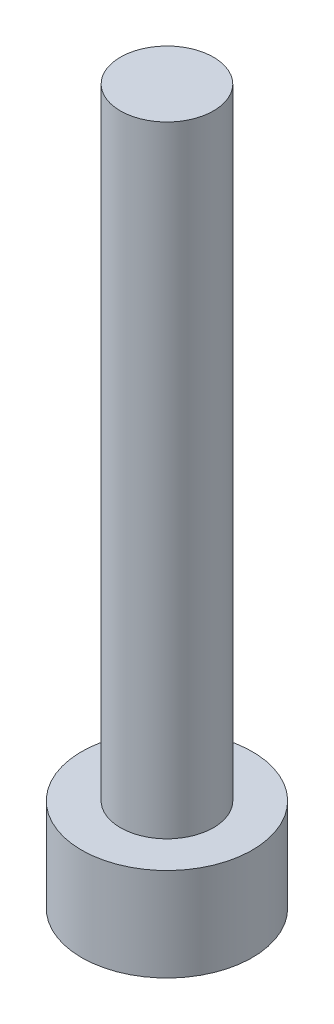
ISO-10303-21;
HEADER;
FILE_DESCRIPTION(('STEP AP214'),'2;1');
FILE_NAME('part.step','',(''),(''),'','','');
FILE_SCHEMA(('AUTOMOTIVE_DESIGN { 1 0 10303 214 1 1 1 1 }'));
ENDSEC;
DATA;
#1=APPLICATION_CONTEXT('core data for automotive mechanical design processes');
#2=APPLICATION_PROTOCOL_DEFINITION('international standard','automotive_design',2000,#1);
#3=PRODUCT_CONTEXT('',#1,'mechanical');
#4=PRODUCT('Part','Part','',(#3));
#5=PRODUCT_RELATED_PRODUCT_CATEGORY('part','',(#4));
#6=PRODUCT_DEFINITION_FORMATION('','',#4);
#7=PRODUCT_DEFINITION_CONTEXT('part definition',#1,'design');
#8=PRODUCT_DEFINITION('design','',#6,#7);
#9=PRODUCT_DEFINITION_SHAPE('','',#8);
#10=(LENGTH_UNIT() NAMED_UNIT(*) SI_UNIT(.MILLI.,.METRE.));
#11=(NAMED_UNIT(*) PLANE_ANGLE_UNIT() SI_UNIT($,.RADIAN.));
#12=(NAMED_UNIT(*) SI_UNIT($,.STERADIAN.) SOLID_ANGLE_UNIT());
#13=UNCERTAINTY_MEASURE_WITH_UNIT(LENGTH_MEASURE(1.E-05),#10,'distance_accuracy_value','');
#14=(GEOMETRIC_REPRESENTATION_CONTEXT(3) GLOBAL_UNCERTAINTY_ASSIGNED_CONTEXT((#13)) GLOBAL_UNIT_ASSIGNED_CONTEXT((#10,
#11,#12)) REPRESENTATION_CONTEXT('',''));
#15=CARTESIAN_POINT('',(0.,0.,0.));
#16=DIRECTION('',(0.,0.,1.));
#17=DIRECTION('',(1.,0.,0.));
#18=AXIS2_PLACEMENT_3D('',#15,#16,#17);
#19=CARTESIAN_POINT('',(0.,3.,0.));
#20=DIRECTION('',(0.,1.,0.));
#21=DIRECTION('',(0.,0.,1.));
#22=AXIS2_PLACEMENT_3D('',#19,#20,#21);
#23=PLANE('',#22);
#24=CARTESIAN_POINT('',(0.,3.,0.));
#25=DIRECTION('',(0.,1.,0.));
#26=DIRECTION('',(0.,0.,1.));
#27=AXIS2_PLACEMENT_3D('',#24,#25,#26);
#28=CIRCLE('',#27,2.75);
#29=CARTESIAN_POINT('',(0.,3.,2.75));
#30=VERTEX_POINT('',#29);
#31=EDGE_CURVE('E11',#30,#30,#28,.T.);
#32=ORIENTED_EDGE('',*,*,#31,.T.);
#33=EDGE_LOOP('',(#32));
#34=FACE_BOUND('',#33,.T.);
#35=CARTESIAN_POINT('',(0.,3.,0.));
#36=DIRECTION('',(0.,1.,0.));
#37=DIRECTION('',(0.,0.,1.));
#38=AXIS2_PLACEMENT_3D('',#35,#36,#37);
#39=CIRCLE('',#38,1.5);
#40=CARTESIAN_POINT('',(0.,3.,1.5));
#41=VERTEX_POINT('',#40);
#42=EDGE_CURVE('E135',#41,#41,#39,.T.);
#43=ORIENTED_EDGE('',*,*,#42,.F.);
#44=EDGE_LOOP('',(#43));
#45=FACE_BOUND('',#44,.T.);
#46=ADVANCED_FACE('F33',(#34,#45),#23,.T.);
#47=CARTESIAN_POINT('',(0.,3.,0.));
#48=DIRECTION('',(0.,-1.,0.));
#49=DIRECTION('',(0.,0.,-1.));
#50=AXIS2_PLACEMENT_3D('',#47,#48,#49);
#51=CYLINDRICAL_SURFACE('',#50,2.75);
#52=ORIENTED_EDGE('',*,*,#31,.F.);
#53=EDGE_LOOP('',(#52));
#54=FACE_BOUND('',#53,.T.);
#55=CARTESIAN_POINT('',(0.,0.,0.));
#56=DIRECTION('',(0.,1.,0.));
#57=DIRECTION('',(0.,0.,1.));
#58=AXIS2_PLACEMENT_3D('',#55,#56,#57);
#59=CIRCLE('',#58,2.75);
#60=CARTESIAN_POINT('',(0.,0.,2.75));
#61=VERTEX_POINT('',#60);
#62=EDGE_CURVE('E37',#61,#61,#59,.T.);
#63=ORIENTED_EDGE('',*,*,#62,.T.);
#64=EDGE_LOOP('',(#63));
#65=FACE_BOUND('',#64,.T.);
#66=ADVANCED_FACE('F35',(#54,#65),#51,.T.);
#67=CARTESIAN_POINT('',(0.,0.,0.));
#68=DIRECTION('',(0.,1.,0.));
#69=DIRECTION('',(0.,0.,1.));
#70=AXIS2_PLACEMENT_3D('',#67,#68,#69);
#71=PLANE('',#70);
#72=DIRECTION('',(-0.866025403784439,0.,-0.5));
#73=VECTOR('',#72,1.);
#74=CARTESIAN_POINT('',(0.,0.,1.44337567297406));
#75=LINE('',#74,#73);
#76=CARTESIAN_POINT('',(0.,0.,1.44337567297406));
#77=VERTEX_POINT('',#76);
#78=CARTESIAN_POINT('',(-1.25,0.,0.721687836487033));
#79=VERTEX_POINT('',#78);
#80=EDGE_CURVE('E122',#77,#79,#75,.T.);
#81=ORIENTED_EDGE('',*,*,#80,.F.);
#82=DIRECTION('',(-0.866025403784439,0.,0.5));
#83=VECTOR('',#82,1.);
#84=CARTESIAN_POINT('',(1.25,0.,0.721687836487032));
#85=LINE('',#84,#83);
#86=CARTESIAN_POINT('',(1.25,0.,0.721687836487032));
#87=VERTEX_POINT('',#86);
#88=EDGE_CURVE('E48',#87,#77,#85,.T.);
#89=ORIENTED_EDGE('',*,*,#88,.F.);
#90=DIRECTION('',(0.,0.,1.));
#91=VECTOR('',#90,1.);
#92=CARTESIAN_POINT('',(1.25,0.,-0.721687836487033));
#93=LINE('',#92,#91);
#94=CARTESIAN_POINT('',(1.25,0.,-0.721687836487033));
#95=VERTEX_POINT('',#94);
#96=EDGE_CURVE('E131',#95,#87,#93,.T.);
#97=ORIENTED_EDGE('',*,*,#96,.F.);
#98=DIRECTION('',(0.866025403784439,0.,0.5));
#99=VECTOR('',#98,1.);
#100=CARTESIAN_POINT('',(0.,0.,-1.44337567297406));
#101=LINE('',#100,#99);
#102=CARTESIAN_POINT('',(0.,0.,-1.44337567297406));
#103=VERTEX_POINT('',#102);
#104=EDGE_CURVE('E129',#103,#95,#101,.T.);
#105=ORIENTED_EDGE('',*,*,#104,.F.);
#106=DIRECTION('',(0.866025403784439,0.,-0.5));
#107=VECTOR('',#106,1.);
#108=CARTESIAN_POINT('',(-1.25,0.,-0.721687836487032));
#109=LINE('',#108,#107);
#110=CARTESIAN_POINT('',(-1.25,0.,-0.721687836487032));
#111=VERTEX_POINT('',#110);
#112=EDGE_CURVE('E96',#111,#103,#109,.T.);
#113=ORIENTED_EDGE('',*,*,#112,.F.);
#114=DIRECTION('',(0.,0.,-1.));
#115=VECTOR('',#114,1.);
#116=CARTESIAN_POINT('',(-1.25,0.,0.721687836487033));
#117=LINE('',#116,#115);
#118=EDGE_CURVE('E125',#79,#111,#117,.T.);
#119=ORIENTED_EDGE('',*,*,#118,.F.);
#120=EDGE_LOOP('',(#81,#89,#97,#105,#113,#119));
#121=FACE_BOUND('',#120,.T.);
#122=ORIENTED_EDGE('',*,*,#62,.F.);
#123=EDGE_LOOP('',(#122));
#124=FACE_BOUND('',#123,.T.);
#125=ADVANCED_FACE('F155',(#121,#124),#71,.F.);
#126=CARTESIAN_POINT('',(0.,23.,0.));
#127=DIRECTION('',(0.,-1.,0.));
#128=DIRECTION('',(0.,0.,-1.));
#129=AXIS2_PLACEMENT_3D('',#126,#127,#128);
#130=CYLINDRICAL_SURFACE('',#129,1.5);
#131=CARTESIAN_POINT('',(0.,23.,0.));
#132=DIRECTION('',(0.,1.,0.));
#133=DIRECTION('',(0.,0.,1.));
#134=AXIS2_PLACEMENT_3D('',#131,#132,#133);
#135=CIRCLE('',#134,1.5);
#136=CARTESIAN_POINT('',(0.,23.,1.5));
#137=VERTEX_POINT('',#136);
#138=EDGE_CURVE('E141',#137,#137,#135,.T.);
#139=ORIENTED_EDGE('',*,*,#138,.F.);
#140=EDGE_LOOP('',(#139));
#141=FACE_BOUND('',#140,.T.);
#142=ORIENTED_EDGE('',*,*,#42,.T.);
#143=EDGE_LOOP('',(#142));
#144=FACE_BOUND('',#143,.T.);
#145=ADVANCED_FACE('F147',(#141,#144),#130,.T.);
#146=CARTESIAN_POINT('',(0.,23.,0.));
#147=DIRECTION('',(0.,1.,0.));
#148=DIRECTION('',(0.,0.,1.));
#149=AXIS2_PLACEMENT_3D('',#146,#147,#148);
#150=PLANE('',#149);
#151=ORIENTED_EDGE('',*,*,#138,.T.);
#152=EDGE_LOOP('',(#151));
#153=FACE_BOUND('',#152,.T.);
#154=ADVANCED_FACE('F164',(#153),#150,.T.);
#155=CARTESIAN_POINT('',(1.25,1.5,0.721687836487032));
#156=DIRECTION('',(0.5,0.,0.866025403784439));
#157=DIRECTION('',(0.866025403784439,0.,-0.5));
#158=AXIS2_PLACEMENT_3D('',#155,#156,#157);
#159=PLANE('',#158);
#160=ORIENTED_EDGE('',*,*,#88,.T.);
#161=DIRECTION('',(0.,-1.,0.));
#162=VECTOR('',#161,1.);
#163=CARTESIAN_POINT('',(0.,1.5,1.44337567297406));
#164=LINE('',#163,#162);
#165=CARTESIAN_POINT('',(0.,1.5,1.44337567297406));
#166=VERTEX_POINT('',#165);
#167=EDGE_CURVE('E78',#166,#77,#164,.T.);
#168=ORIENTED_EDGE('',*,*,#167,.F.);
#169=DIRECTION('',(-0.866025403784439,0.,0.5));
#170=VECTOR('',#169,1.);
#171=CARTESIAN_POINT('',(1.25,1.5,0.721687836487032));
#172=LINE('',#171,#170);
#173=CARTESIAN_POINT('',(1.25,1.5,0.721687836487032));
#174=VERTEX_POINT('',#173);
#175=EDGE_CURVE('E133',#174,#166,#172,.T.);
#176=ORIENTED_EDGE('',*,*,#175,.F.);
#177=DIRECTION('',(0.,-1.,0.));
#178=VECTOR('',#177,1.);
#179=CARTESIAN_POINT('',(1.25,1.5,0.721687836487032));
#180=LINE('',#179,#178);
#181=EDGE_CURVE('E56',#174,#87,#180,.T.);
#182=ORIENTED_EDGE('',*,*,#181,.T.);
#183=EDGE_LOOP('',(#160,#168,#176,#182));
#184=FACE_BOUND('',#183,.T.);
#185=ADVANCED_FACE('F176',(#184),#159,.F.);
#186=CARTESIAN_POINT('',(1.25,1.5,-0.721687836487033));
#187=DIRECTION('',(1.,0.,0.));
#188=DIRECTION('',(0.,0.,-1.));
#189=AXIS2_PLACEMENT_3D('',#186,#187,#188);
#190=PLANE('',#189);
#191=ORIENTED_EDGE('',*,*,#96,.T.);
#192=ORIENTED_EDGE('',*,*,#181,.F.);
#193=DIRECTION('',(0.,0.,1.));
#194=VECTOR('',#193,1.);
#195=CARTESIAN_POINT('',(1.25,1.5,-0.721687836487033));
#196=LINE('',#195,#194);
#197=CARTESIAN_POINT('',(1.25,1.5,-0.721687836487033));
#198=VERTEX_POINT('',#197);
#199=EDGE_CURVE('E108',#198,#174,#196,.T.);
#200=ORIENTED_EDGE('',*,*,#199,.F.);
#201=DIRECTION('',(0.,-1.,0.));
#202=VECTOR('',#201,1.);
#203=CARTESIAN_POINT('',(1.25,1.5,-0.721687836487033));
#204=LINE('',#203,#202);
#205=EDGE_CURVE('E100',#198,#95,#204,.T.);
#206=ORIENTED_EDGE('',*,*,#205,.T.);
#207=EDGE_LOOP('',(#191,#192,#200,#206));
#208=FACE_BOUND('',#207,.T.);
#209=ADVANCED_FACE('F178',(#208),#190,.F.);
#210=CARTESIAN_POINT('',(0.,1.5,-1.44337567297406));
#211=DIRECTION('',(0.5,0.,-0.866025403784439));
#212=DIRECTION('',(-0.866025403784439,0.,-0.5));
#213=AXIS2_PLACEMENT_3D('',#210,#211,#212);
#214=PLANE('',#213);
#215=ORIENTED_EDGE('',*,*,#104,.T.);
#216=ORIENTED_EDGE('',*,*,#205,.F.);
#217=DIRECTION('',(0.866025403784439,0.,0.5));
#218=VECTOR('',#217,1.);
#219=CARTESIAN_POINT('',(0.,1.5,-1.44337567297406));
#220=LINE('',#219,#218);
#221=CARTESIAN_POINT('',(0.,1.5,-1.44337567297406));
#222=VERTEX_POINT('',#221);
#223=EDGE_CURVE('E104',#222,#198,#220,.T.);
#224=ORIENTED_EDGE('',*,*,#223,.F.);
#225=DIRECTION('',(0.,-1.,0.));
#226=VECTOR('',#225,1.);
#227=CARTESIAN_POINT('',(0.,1.5,-1.44337567297406));
#228=LINE('',#227,#226);
#229=EDGE_CURVE('E89',#222,#103,#228,.T.);
#230=ORIENTED_EDGE('',*,*,#229,.T.);
#231=EDGE_LOOP('',(#215,#216,#224,#230));
#232=FACE_BOUND('',#231,.T.);
#233=ADVANCED_FACE('F105',(#232),#214,.F.);
#234=CARTESIAN_POINT('',(-1.25,1.5,-0.721687836487032));
#235=DIRECTION('',(-0.5,0.,-0.866025403784439));
#236=DIRECTION('',(-0.866025403784439,0.,0.5));
#237=AXIS2_PLACEMENT_3D('',#234,#235,#236);
#238=PLANE('',#237);
#239=ORIENTED_EDGE('',*,*,#112,.T.);
#240=ORIENTED_EDGE('',*,*,#229,.F.);
#241=DIRECTION('',(0.866025403784439,0.,-0.5));
#242=VECTOR('',#241,1.);
#243=CARTESIAN_POINT('',(-1.25,1.5,-0.721687836487032));
#244=LINE('',#243,#242);
#245=CARTESIAN_POINT('',(-1.25,1.5,-0.721687836487032));
#246=VERTEX_POINT('',#245);
#247=EDGE_CURVE('E93',#246,#222,#244,.T.);
#248=ORIENTED_EDGE('',*,*,#247,.F.);
#249=DIRECTION('',(0.,-1.,0.));
#250=VECTOR('',#249,1.);
#251=CARTESIAN_POINT('',(-1.25,1.5,-0.721687836487032));
#252=LINE('',#251,#250);
#253=EDGE_CURVE('E101',#246,#111,#252,.T.);
#254=ORIENTED_EDGE('',*,*,#253,.T.);
#255=EDGE_LOOP('',(#239,#240,#248,#254));
#256=FACE_BOUND('',#255,.T.);
#257=ADVANCED_FACE('F91',(#256),#238,.F.);
#258=CARTESIAN_POINT('',(-1.25,1.5,0.721687836487033));
#259=DIRECTION('',(-1.,0.,0.));
#260=DIRECTION('',(0.,0.,1.));
#261=AXIS2_PLACEMENT_3D('',#258,#259,#260);
#262=PLANE('',#261);
#263=ORIENTED_EDGE('',*,*,#118,.T.);
#264=ORIENTED_EDGE('',*,*,#253,.F.);
#265=DIRECTION('',(0.,0.,-1.));
#266=VECTOR('',#265,1.);
#267=CARTESIAN_POINT('',(-1.25,1.5,0.721687836487033));
#268=LINE('',#267,#266);
#269=CARTESIAN_POINT('',(-1.25,1.5,0.721687836487033));
#270=VERTEX_POINT('',#269);
#271=EDGE_CURVE('E114',#270,#246,#268,.T.);
#272=ORIENTED_EDGE('',*,*,#271,.F.);
#273=DIRECTION('',(0.,-1.,0.));
#274=VECTOR('',#273,1.);
#275=CARTESIAN_POINT('',(-1.25,1.5,0.721687836487033));
#276=LINE('',#275,#274);
#277=EDGE_CURVE('E138',#270,#79,#276,.T.);
#278=ORIENTED_EDGE('',*,*,#277,.T.);
#279=EDGE_LOOP('',(#263,#264,#272,#278));
#280=FACE_BOUND('',#279,.T.);
#281=ADVANCED_FACE('F189',(#280),#262,.F.);
#282=CARTESIAN_POINT('',(0.,1.5,1.44337567297406));
#283=DIRECTION('',(-0.5,0.,0.866025403784439));
#284=DIRECTION('',(0.866025403784439,0.,0.5));
#285=AXIS2_PLACEMENT_3D('',#282,#283,#284);
#286=PLANE('',#285);
#287=ORIENTED_EDGE('',*,*,#80,.T.);
#288=ORIENTED_EDGE('',*,*,#277,.F.);
#289=DIRECTION('',(-0.866025403784439,0.,-0.5));
#290=VECTOR('',#289,1.);
#291=CARTESIAN_POINT('',(0.,1.5,1.44337567297406));
#292=LINE('',#291,#290);
#293=EDGE_CURVE('E116',#166,#270,#292,.T.);
#294=ORIENTED_EDGE('',*,*,#293,.F.);
#295=ORIENTED_EDGE('',*,*,#167,.T.);
#296=EDGE_LOOP('',(#287,#288,#294,#295));
#297=FACE_BOUND('',#296,.T.);
#298=ADVANCED_FACE('F174',(#297),#286,.F.);
#299=CARTESIAN_POINT('',(0.,1.5,0.));
#300=DIRECTION('',(0.,-1.,0.));
#301=DIRECTION('',(0.,0.,-1.));
#302=AXIS2_PLACEMENT_3D('',#299,#300,#301);
#303=PLANE('',#302);
#304=ORIENTED_EDGE('',*,*,#175,.T.);
#305=ORIENTED_EDGE('',*,*,#293,.T.);
#306=ORIENTED_EDGE('',*,*,#271,.T.);
#307=ORIENTED_EDGE('',*,*,#247,.T.);
#308=ORIENTED_EDGE('',*,*,#223,.T.);
#309=ORIENTED_EDGE('',*,*,#199,.T.);
#310=EDGE_LOOP('',(#304,#305,#306,#307,#308,#309));
#311=FACE_BOUND('',#310,.T.);
#312=ADVANCED_FACE('F111',(#311),#303,.T.);
#313=CLOSED_SHELL('',(#46,#66,#125,#145,#154,#185,#209,#233,#257,#281,#298,#312));
#314=MANIFOLD_SOLID_BREP('B2',#313);
#315=ADVANCED_BREP_SHAPE_REPRESENTATION('',(#18,#314),#14);
#316=SHAPE_DEFINITION_REPRESENTATION(#9,#315);
ENDSEC;
END-ISO-10303-21;
